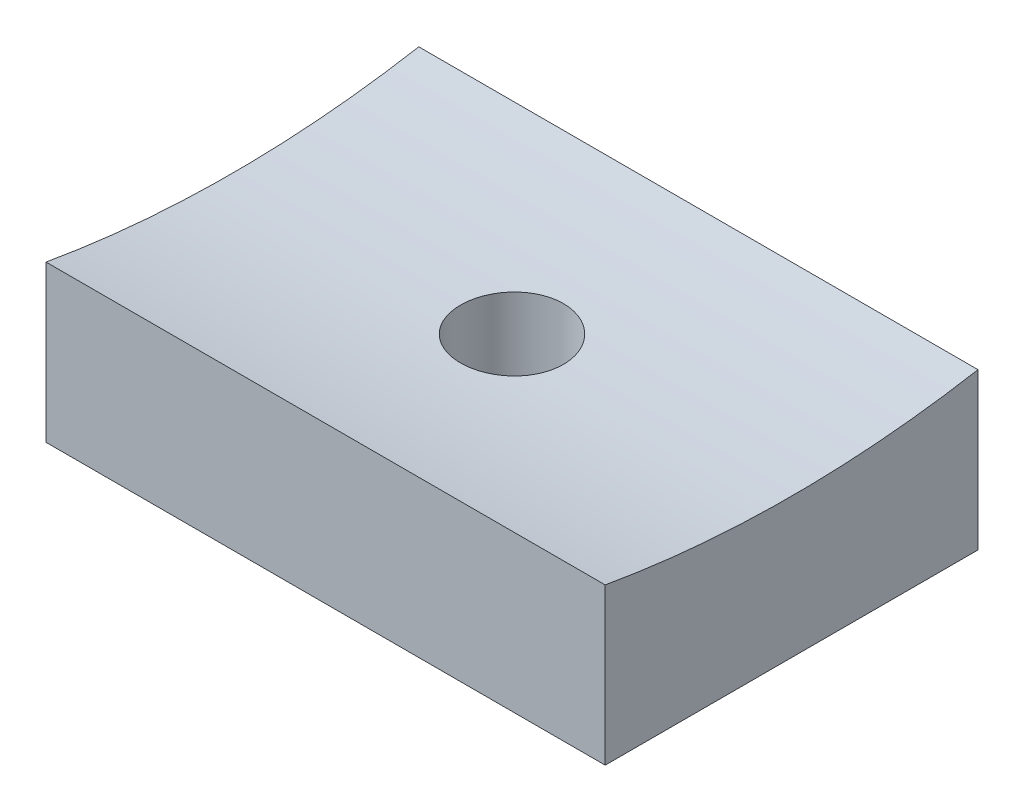
ISO-10303-21;
HEADER;
FILE_DESCRIPTION(('STEP AP214'),'2;1');
FILE_NAME('part.step','',(''),(''),'','','');
FILE_SCHEMA(('AUTOMOTIVE_DESIGN { 1 0 10303 214 1 1 1 1 }'));
ENDSEC;
DATA;
#1=APPLICATION_CONTEXT('core data for automotive mechanical design processes');
#2=APPLICATION_PROTOCOL_DEFINITION('international standard','automotive_design',2000,#1);
#3=PRODUCT_CONTEXT('',#1,'mechanical');
#4=PRODUCT('Part','Part','',(#3));
#5=PRODUCT_RELATED_PRODUCT_CATEGORY('part','',(#4));
#6=PRODUCT_DEFINITION_FORMATION('','',#4);
#7=PRODUCT_DEFINITION_CONTEXT('part definition',#1,'design');
#8=PRODUCT_DEFINITION('design','',#6,#7);
#9=PRODUCT_DEFINITION_SHAPE('','',#8);
#10=(LENGTH_UNIT() NAMED_UNIT(*) SI_UNIT(.MILLI.,.METRE.));
#11=(NAMED_UNIT(*) PLANE_ANGLE_UNIT() SI_UNIT($,.RADIAN.));
#12=(NAMED_UNIT(*) SI_UNIT($,.STERADIAN.) SOLID_ANGLE_UNIT());
#13=UNCERTAINTY_MEASURE_WITH_UNIT(LENGTH_MEASURE(1.E-05),#10,'distance_accuracy_value','');
#14=(GEOMETRIC_REPRESENTATION_CONTEXT(3) GLOBAL_UNCERTAINTY_ASSIGNED_CONTEXT((#13)) GLOBAL_UNIT_ASSIGNED_CONTEXT((#10,
#11,#12)) REPRESENTATION_CONTEXT('',''));
#15=CARTESIAN_POINT('',(0.,0.,0.));
#16=DIRECTION('',(0.,0.,1.));
#17=DIRECTION('',(1.,0.,0.));
#18=AXIS2_PLACEMENT_3D('',#15,#16,#17);
#19=CARTESIAN_POINT('',(-9.525,41.275,-6.35));
#20=DIRECTION('',(1.,0.,0.));
#21=DIRECTION('',(0.,0.,-1.));
#22=AXIS2_PLACEMENT_3D('',#19,#20,#21);
#23=PLANE('',#22);
#24=DIRECTION('',(0.,-1.,0.));
#25=VECTOR('',#24,1.);
#26=CARTESIAN_POINT('',(-9.525,41.275,6.35));
#27=LINE('',#26,#25);
#28=CARTESIAN_POINT('',(-9.525,5.31891350202306,6.35));
#29=VERTEX_POINT('',#28);
#30=CARTESIAN_POINT('',(-9.525,0.,6.35));
#31=VERTEX_POINT('',#30);
#32=EDGE_CURVE('E46',#29,#31,#27,.T.);
#33=ORIENTED_EDGE('',*,*,#32,.F.);
#34=CARTESIAN_POINT('',(-9.525,41.275,0.));
#35=DIRECTION('',(-1.,0.,0.));
#36=DIRECTION('',(0.,0.,1.));
#37=AXIS2_PLACEMENT_3D('',#34,#35,#36);
#38=CIRCLE('',#37,36.5125);
#39=CARTESIAN_POINT('',(-9.525,5.31891350202306,-6.35));
#40=VERTEX_POINT('',#39);
#41=EDGE_CURVE('E78',#40,#29,#38,.T.);
#42=ORIENTED_EDGE('',*,*,#41,.F.);
#43=DIRECTION('',(0.,-1.,0.));
#44=VECTOR('',#43,1.);
#45=CARTESIAN_POINT('',(-9.525,41.275,-6.35));
#46=LINE('',#45,#44);
#47=CARTESIAN_POINT('',(-9.525,0.,-6.35));
#48=VERTEX_POINT('',#47);
#49=EDGE_CURVE('E60',#40,#48,#46,.T.);
#50=ORIENTED_EDGE('',*,*,#49,.T.);
#51=DIRECTION('',(0.,0.,1.));
#52=VECTOR('',#51,1.);
#53=CARTESIAN_POINT('',(-9.525,0.,-6.35));
#54=LINE('',#53,#52);
#55=EDGE_CURVE('E107',#48,#31,#54,.T.);
#56=ORIENTED_EDGE('',*,*,#55,.T.);
#57=EDGE_LOOP('',(#33,#42,#50,#56));
#58=FACE_BOUND('',#57,.T.);
#59=ADVANCED_FACE('F34',(#58),#23,.F.);
#60=CARTESIAN_POINT('',(-9.525,41.275,6.35));
#61=DIRECTION('',(0.,0.,-1.));
#62=DIRECTION('',(-1.,0.,0.));
#63=AXIS2_PLACEMENT_3D('',#60,#61,#62);
#64=PLANE('',#63);
#65=DIRECTION('',(0.,-1.,0.));
#66=VECTOR('',#65,1.);
#67=CARTESIAN_POINT('',(9.525,41.275,6.35));
#68=LINE('',#67,#66);
#69=CARTESIAN_POINT('',(9.525,5.31891350202306,6.35));
#70=VERTEX_POINT('',#69);
#71=CARTESIAN_POINT('',(9.525,0.,6.35));
#72=VERTEX_POINT('',#71);
#73=EDGE_CURVE('E90',#70,#72,#68,.T.);
#74=ORIENTED_EDGE('',*,*,#73,.F.);
#75=DIRECTION('',(-1.,0.,0.));
#76=VECTOR('',#75,1.);
#77=CARTESIAN_POINT('',(31.75,5.31891350202306,6.35));
#78=LINE('',#77,#76);
#79=EDGE_CURVE('E104',#70,#29,#78,.T.);
#80=ORIENTED_EDGE('',*,*,#79,.T.);
#81=ORIENTED_EDGE('',*,*,#32,.T.);
#82=DIRECTION('',(1.,0.,0.));
#83=VECTOR('',#82,1.);
#84=CARTESIAN_POINT('',(-9.525,0.,6.35));
#85=LINE('',#84,#83);
#86=EDGE_CURVE('E102',#31,#72,#85,.T.);
#87=ORIENTED_EDGE('',*,*,#86,.T.);
#88=EDGE_LOOP('',(#74,#80,#81,#87));
#89=FACE_BOUND('',#88,.T.);
#90=ADVANCED_FACE('F101',(#89),#64,.F.);
#91=CARTESIAN_POINT('',(9.525,41.275,-6.35));
#92=DIRECTION('',(-1.,0.,0.));
#93=DIRECTION('',(0.,0.,1.));
#94=AXIS2_PLACEMENT_3D('',#91,#92,#93);
#95=PLANE('',#94);
#96=DIRECTION('',(0.,-1.,0.));
#97=VECTOR('',#96,1.);
#98=CARTESIAN_POINT('',(9.525,41.275,-6.35));
#99=LINE('',#98,#97);
#100=CARTESIAN_POINT('',(9.525,5.31891350202306,-6.35));
#101=VERTEX_POINT('',#100);
#102=CARTESIAN_POINT('',(9.525,0.,-6.35));
#103=VERTEX_POINT('',#102);
#104=EDGE_CURVE('E88',#101,#103,#99,.T.);
#105=ORIENTED_EDGE('',*,*,#104,.F.);
#106=CARTESIAN_POINT('',(9.525,41.275,0.));
#107=DIRECTION('',(-1.,0.,0.));
#108=DIRECTION('',(0.,0.,1.));
#109=AXIS2_PLACEMENT_3D('',#106,#107,#108);
#110=CIRCLE('',#109,36.5125);
#111=EDGE_CURVE('E53',#101,#70,#110,.T.);
#112=ORIENTED_EDGE('',*,*,#111,.T.);
#113=ORIENTED_EDGE('',*,*,#73,.T.);
#114=DIRECTION('',(0.,0.,-1.));
#115=VECTOR('',#114,1.);
#116=CARTESIAN_POINT('',(9.525,0.,-6.35));
#117=LINE('',#116,#115);
#118=EDGE_CURVE('E92',#72,#103,#117,.T.);
#119=ORIENTED_EDGE('',*,*,#118,.T.);
#120=EDGE_LOOP('',(#105,#112,#113,#119));
#121=FACE_BOUND('',#120,.T.);
#122=ADVANCED_FACE('F114',(#121),#95,.F.);
#123=CARTESIAN_POINT('',(-9.525,41.275,-6.35));
#124=DIRECTION('',(0.,0.,1.));
#125=DIRECTION('',(1.,0.,0.));
#126=AXIS2_PLACEMENT_3D('',#123,#124,#125);
#127=PLANE('',#126);
#128=ORIENTED_EDGE('',*,*,#49,.F.);
#129=DIRECTION('',(-1.,0.,0.));
#130=VECTOR('',#129,1.);
#131=CARTESIAN_POINT('',(31.75,5.31891350202306,-6.35));
#132=LINE('',#131,#130);
#133=EDGE_CURVE('E11',#40,#101,#132,.F.);
#134=ORIENTED_EDGE('',*,*,#133,.T.);
#135=ORIENTED_EDGE('',*,*,#104,.T.);
#136=DIRECTION('',(-1.,0.,0.));
#137=VECTOR('',#136,1.);
#138=CARTESIAN_POINT('',(-9.525,0.,-6.35));
#139=LINE('',#138,#137);
#140=EDGE_CURVE('E86',#103,#48,#139,.T.);
#141=ORIENTED_EDGE('',*,*,#140,.T.);
#142=EDGE_LOOP('',(#128,#134,#135,#141));
#143=FACE_BOUND('',#142,.T.);
#144=ADVANCED_FACE('F84',(#143),#127,.F.);
#145=CARTESIAN_POINT('',(-9.525,0.,-6.35));
#146=DIRECTION('',(0.,1.,0.));
#147=DIRECTION('',(0.,0.,1.));
#148=AXIS2_PLACEMENT_3D('',#145,#146,#147);
#149=PLANE('',#148);
#150=CARTESIAN_POINT('',(0.,0.,0.));
#151=DIRECTION('',(0.,-1.,0.));
#152=DIRECTION('',(0.,0.,-1.));
#153=AXIS2_PLACEMENT_3D('',#150,#151,#152);
#154=CIRCLE('',#153,1.7526);
#155=CARTESIAN_POINT('',(0.,0.,-1.7526));
#156=VERTEX_POINT('',#155);
#157=EDGE_CURVE('E116',#156,#156,#154,.T.);
#158=ORIENTED_EDGE('',*,*,#157,.F.);
#159=EDGE_LOOP('',(#158));
#160=FACE_BOUND('',#159,.T.);
#161=ORIENTED_EDGE('',*,*,#55,.F.);
#162=ORIENTED_EDGE('',*,*,#140,.F.);
#163=ORIENTED_EDGE('',*,*,#118,.F.);
#164=ORIENTED_EDGE('',*,*,#86,.F.);
#165=EDGE_LOOP('',(#161,#162,#163,#164));
#166=FACE_BOUND('',#165,.T.);
#167=ADVANCED_FACE('F106',(#160,#166),#149,.F.);
#168=CARTESIAN_POINT('',(31.75,41.275,0.));
#169=DIRECTION('',(-1.,0.,0.));
#170=DIRECTION('',(0.,0.,1.));
#171=AXIS2_PLACEMENT_3D('',#168,#169,#170);
#172=CYLINDRICAL_SURFACE('',#171,36.5125);
#173=CARTESIAN_POINT('',(0.,4.80458665589325,-1.7526));
#174=CARTESIAN_POINT('',(0.0983834524164731,4.80458609022049,-1.75259565623278));
#175=CARTESIAN_POINT('',(0.196836798623562,4.80418427496949,-1.74428793999446));
#176=CARTESIAN_POINT('',(0.39102785891969,4.80262013527594,-1.71126443587451));
#177=CARTESIAN_POINT('',(0.486762228681062,4.80145691327182,-1.68652928249667));
#178=CARTESIAN_POINT('',(0.672674159768497,4.7985020264381,-1.62136042363667));
#179=CARTESIAN_POINT('',(0.762854512967955,4.79671068043345,-1.58093468131688));
#180=CARTESIAN_POINT('',(0.935124763999044,4.79270179731753,-1.48554431172094));
#181=CARTESIAN_POINT('',(1.0172165732157,4.79048436126176,-1.43058313064474));
#182=CARTESIAN_POINT('',(1.17108150304802,4.7858707632846,-1.30762405200433));
#183=CARTESIAN_POINT('',(1.24284605912219,4.78347445549479,-1.23961544182045));
#184=CARTESIAN_POINT('',(1.37394639529081,4.77877451244622,-1.09251326186598));
#185=CARTESIAN_POINT('',(1.433281669589,4.7764708809619,-1.01341924120503));
#186=CARTESIAN_POINT('',(1.53786200174279,4.77221479754551,-0.846347498539691));
#187=CARTESIAN_POINT('',(1.5831004971474,4.77026250935184,-0.758365664167101));
#188=CARTESIAN_POINT('',(1.65816096678187,4.766930574056,-0.576044753376514));
#189=CARTESIAN_POINT('',(1.68798305095259,4.76555092287013,-0.481705722299755));
#190=CARTESIAN_POINT('',(1.73134183285749,4.76352070294045,-0.289426163213173));
#191=CARTESIAN_POINT('',(1.74489118516451,4.76286956768949,-0.191488494868396));
#192=CARTESIAN_POINT('',(1.75535893512224,4.76236785916255,0.00527320163455312));
#193=CARTESIAN_POINT('',(1.75227745575236,4.76251727996672,0.104097223233046));
#194=CARTESIAN_POINT('',(1.72958152872172,4.76359936709828,0.299740688120376));
#195=CARTESIAN_POINT('',(1.70998070431663,4.76453138802478,0.396561715859602));
#196=CARTESIAN_POINT('',(1.65482359685318,4.76707294385352,0.585537594205267));
#197=CARTESIAN_POINT('',(1.61926725076366,4.76868248143225,0.677692426376633));
#198=CARTESIAN_POINT('',(1.53319286773516,4.77239886635081,0.854763851300029));
#199=CARTESIAN_POINT('',(1.48266861918801,4.77450592008365,0.939677420083697));
#200=CARTESIAN_POINT('',(1.36809717124198,4.77898002919724,1.09982287364412));
#201=CARTESIAN_POINT('',(1.30404988425243,4.78134708626203,1.17505469570572));
#202=CARTESIAN_POINT('',(1.1641734004316,4.78607743053225,1.31378054726122));
#203=CARTESIAN_POINT('',(1.0883323845378,4.78844071152672,1.37726266048432));
#204=CARTESIAN_POINT('',(0.927062829769802,4.79289467249213,1.49059528058355));
#205=CARTESIAN_POINT('',(0.841634288493805,4.79498535239477,1.54044578404475));
#206=CARTESIAN_POINT('',(0.663607550670372,4.79865816679605,1.62509904198957));
#207=CARTESIAN_POINT('',(0.571009144309223,4.80024028640558,1.65990135591754));
#208=CARTESIAN_POINT('',(0.38127442568991,4.80271699100133,1.71346240186367));
#209=CARTESIAN_POINT('',(0.28413814489269,4.80361158075342,1.73222124509332));
#210=CARTESIAN_POINT('',(0.0881888069463331,4.80461146457709,1.75314813138846));
#211=CARTESIAN_POINT('',(-0.0106224804002357,4.80471754531966,1.75533271012904));
#212=CARTESIAN_POINT('',(-0.207208164622753,4.80413050212769,1.74309219975385));
#213=CARTESIAN_POINT('',(-0.304982564653334,4.80343738062535,1.72866716118594));
#214=CARTESIAN_POINT('',(-0.496672608954416,4.80133077396545,1.68363060199938));
#215=CARTESIAN_POINT('',(-0.590590033891932,4.79991762535961,1.65302664340565));
#216=CARTESIAN_POINT('',(-0.771954991124787,4.79653052884202,1.57650863195574));
#217=CARTESIAN_POINT('',(-0.859402488952976,4.79455657794298,1.53059449754506));
#218=CARTESIAN_POINT('',(-1.02542136611077,4.79026844862608,1.42471700574457));
#219=CARTESIAN_POINT('',(-1.10398565231469,4.78795400167258,1.36474253716693));
#220=CARTESIAN_POINT('',(-1.24993661713483,4.78324669319865,1.23246307452245));
#221=CARTESIAN_POINT('',(-1.31732322956096,4.78085383121398,1.16015800744346));
#222=CARTESIAN_POINT('',(-1.4390615110822,4.77625709883994,1.00519882408048));
#223=CARTESIAN_POINT('',(-1.49340250165739,4.77405338421901,0.922536313345937));
#224=CARTESIAN_POINT('',(-1.5874340018012,4.77008553925903,0.749251196763475));
#225=CARTESIAN_POINT('',(-1.62712457139355,4.76832140711901,0.658628623530333));
#226=CARTESIAN_POINT('',(-1.69070987664292,4.76543229528921,0.47203561367418));
#227=CARTESIAN_POINT('',(-1.71461145409244,4.76430703878727,0.376067512984938));
#228=CARTESIAN_POINT('',(-1.74596270545317,4.76282139706406,0.181474885659752));
#229=CARTESIAN_POINT('',(-1.75341246257455,4.76246100797424,0.082850372461991));
#230=CARTESIAN_POINT('',(-1.75164779619586,4.76254569947596,-0.114149446482832));
#231=CARTESIAN_POINT('',(-1.74245012942111,4.76298997012493,-0.212524903121334));
#232=CARTESIAN_POINT('',(-1.70768632567227,4.76463236713943,-0.406333304577113));
#233=CARTESIAN_POINT('',(-1.68212015762954,4.76583049493582,-0.501766243808914));
#234=CARTESIAN_POINT('',(-1.61534844008402,4.76884579070242,-0.686984313329165));
#235=CARTESIAN_POINT('',(-1.5741427514124,4.7706629641812,-0.776769393351647));
#236=CARTESIAN_POINT('',(-1.47726472095526,4.77471193900102,-0.948147844544519));
#237=CARTESIAN_POINT('',(-1.42159283290063,4.77694372733708,-1.02974147252773));
#238=CARTESIAN_POINT('',(-1.29730324696738,4.78157324985089,-1.18250425422381));
#239=CARTESIAN_POINT('',(-1.22867397657764,4.78397113114827,-1.25366398748873));
#240=CARTESIAN_POINT('',(-1.08042331884079,4.78866163566737,-1.38347399148034));
#241=CARTESIAN_POINT('',(-1.00079922910072,4.79095423282635,-1.44212117772784));
#242=CARTESIAN_POINT('',(-0.832760418491558,4.79517704474347,-1.54526665694637));
#243=CARTESIAN_POINT('',(-0.744337667502654,4.79710692373961,-1.58975186658393));
#244=CARTESIAN_POINT('',(-0.561335539939655,4.80038125867231,-1.66319211600402));
#245=CARTESIAN_POINT('',(-0.46676359331536,4.8017264065543,-1.69216552124258));
#246=CARTESIAN_POINT('',(-0.309669033597225,4.80332300933188,-1.72615026404213));
#247=CARTESIAN_POINT('',(-0.248164229164606,4.80379479075618,-1.73605627426198));
#248=CARTESIAN_POINT('',(-0.124448939873126,4.80442679283992,-1.74928251361212));
#249=CARTESIAN_POINT('',(-0.0622384555685553,4.80458701374407,-1.75260274791498));
#250=CARTESIAN_POINT('',(0.,4.80458665589325,-1.7526));
#251=B_SPLINE_CURVE_WITH_KNOTS('',3,(#173,#174,#175,#176,#177,#178,#179,#180,#181,#182,#183,
#184,#185,#186,#187,#188,#189,#190,#191,#192,#193,#194,#195,#196,#197,#198,#199,#200,#201,#202,
#203,#204,#205,#206,#207,#208,#209,#210,#211,#212,#213,#214,#215,#216,#217,#218,#219,#220,#221,
#222,#223,#224,#225,#226,#227,#228,#229,#230,#231,#232,#233,#234,#235,#236,#237,#238,#239,#240,
#241,#242,#243,#244,#245,#246,#247,#248,#249,#250),.UNSPECIFIED.,.T.,.F.,(4,2,2,2,2,2,2,2,2,2,2,
2,2,2,2,2,2,2,2,2,2,2,2,2,2,2,2,2,2,2,2,2,2,2,2,2,2,2,4),(0.,0.294923164883486,
0.590194618743975,0.885316414327295,1.18036830226023,1.47566348804148,1.77097068820964,
2.06641515759556,2.36185752001491,2.65706998110039,2.95228025919199,3.24724731975877,
3.5422155455821,3.83730635369845,4.13239907321931,4.42778944812246,4.7231798970252,
5.0185789932883,5.31397604186235,5.60907834234972,5.90417974475808,6.19914333860289,
6.49410850368985,6.78930755561928,7.08450835554685,7.37994997501761,7.67539038403132,
7.97070268668921,8.26601349571028,8.56102722030067,8.85604150485071,9.15105841465765,
9.44606607240537,9.74133846486811,10.0366835613075,10.3323007214549,10.6275671024233,
10.8141388912726,11.0007105335854),.UNSPECIFIED.);
#252=CARTESIAN_POINT('',(0.,4.80458665589325,-1.7526));
#253=VERTEX_POINT('',#252);
#254=EDGE_CURVE('E37',#253,#253,#251,.T.);
#255=ORIENTED_EDGE('',*,*,#254,.T.);
#256=EDGE_LOOP('',(#255));
#257=FACE_BOUND('',#256,.T.);
#258=ORIENTED_EDGE('',*,*,#111,.F.);
#259=ORIENTED_EDGE('',*,*,#133,.F.);
#260=ORIENTED_EDGE('',*,*,#41,.T.);
#261=ORIENTED_EDGE('',*,*,#79,.F.);
#262=EDGE_LOOP('',(#258,#259,#260,#261));
#263=FACE_BOUND('',#262,.T.);
#264=ADVANCED_FACE('F77',(#257,#263),#172,.F.);
#265=CARTESIAN_POINT('',(0.,0.,0.));
#266=DIRECTION('',(0.,-1.,0.));
#267=DIRECTION('',(0.,0.,-1.));
#268=AXIS2_PLACEMENT_3D('',#265,#266,#267);
#269=CYLINDRICAL_SURFACE('',#268,1.7526);
#270=ORIENTED_EDGE('',*,*,#157,.T.);
#271=EDGE_LOOP('',(#270));
#272=FACE_BOUND('',#271,.T.);
#273=ORIENTED_EDGE('',*,*,#254,.F.);
#274=EDGE_LOOP('',(#273));
#275=FACE_BOUND('',#274,.T.);
#276=ADVANCED_FACE('F124',(#272,#275),#269,.F.);
#277=CLOSED_SHELL('',(#59,#90,#122,#144,#167,#264,#276));
#278=MANIFOLD_SOLID_BREP('B2',#277);
#279=ADVANCED_BREP_SHAPE_REPRESENTATION('',(#18,#278),#14);
#280=SHAPE_DEFINITION_REPRESENTATION(#9,#279);
ENDSEC;
END-ISO-10303-21;
